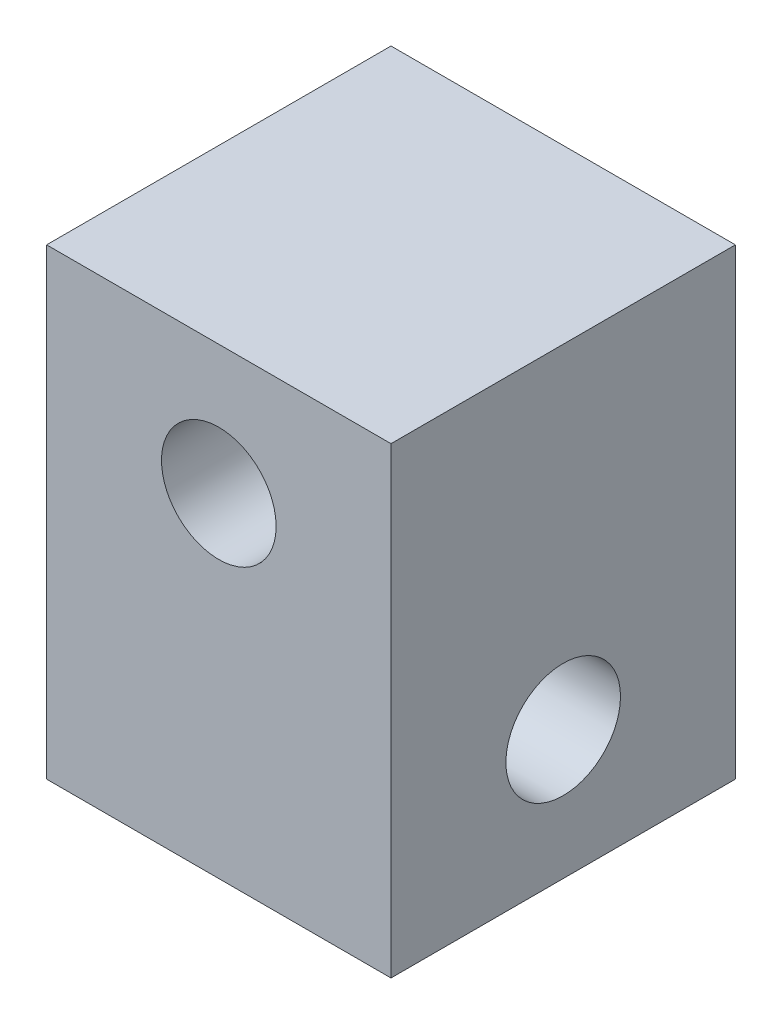
ISO-10303-21;
HEADER;
FILE_DESCRIPTION(('STEP AP214'),'2;1');
FILE_NAME('part.step','',(''),(''),'','','');
FILE_SCHEMA(('AUTOMOTIVE_DESIGN { 1 0 10303 214 1 1 1 1 }'));
ENDSEC;
DATA;
#1=APPLICATION_CONTEXT('core data for automotive mechanical design processes');
#2=APPLICATION_PROTOCOL_DEFINITION('international standard','automotive_design',2000,#1);
#3=PRODUCT_CONTEXT('',#1,'mechanical');
#4=PRODUCT('Part','Part','',(#3));
#5=PRODUCT_RELATED_PRODUCT_CATEGORY('part','',(#4));
#6=PRODUCT_DEFINITION_FORMATION('','',#4);
#7=PRODUCT_DEFINITION_CONTEXT('part definition',#1,'design');
#8=PRODUCT_DEFINITION('design','',#6,#7);
#9=PRODUCT_DEFINITION_SHAPE('','',#8);
#10=(LENGTH_UNIT() NAMED_UNIT(*) SI_UNIT(.MILLI.,.METRE.));
#11=(NAMED_UNIT(*) PLANE_ANGLE_UNIT() SI_UNIT($,.RADIAN.));
#12=(NAMED_UNIT(*) SI_UNIT($,.STERADIAN.) SOLID_ANGLE_UNIT());
#13=UNCERTAINTY_MEASURE_WITH_UNIT(LENGTH_MEASURE(1.E-05),#10,'distance_accuracy_value','');
#14=(GEOMETRIC_REPRESENTATION_CONTEXT(3) GLOBAL_UNCERTAINTY_ASSIGNED_CONTEXT((#13)) GLOBAL_UNIT_ASSIGNED_CONTEXT((#10,
#11,#12)) REPRESENTATION_CONTEXT('',''));
#15=CARTESIAN_POINT('',(0.,0.,0.));
#16=DIRECTION('',(0.,0.,1.));
#17=DIRECTION('',(1.,0.,0.));
#18=AXIS2_PLACEMENT_3D('',#15,#16,#17);
#19=CARTESIAN_POINT('',(0.,7.874,4.064));
#20=DIRECTION('',(0.,0.,1.));
#21=DIRECTION('',(1.,0.,0.));
#22=AXIS2_PLACEMENT_3D('',#19,#20,#21);
#23=CYLINDRICAL_SURFACE('',#22,1.35254999999999);
#24=CARTESIAN_POINT('',(0.,7.874,-4.064));
#25=DIRECTION('',(0.,0.,1.));
#26=DIRECTION('',(1.,0.,0.));
#27=AXIS2_PLACEMENT_3D('',#24,#25,#26);
#28=CIRCLE('',#27,1.35254999999999);
#29=CARTESIAN_POINT('',(1.35254999999999,7.874,-4.064));
#30=VERTEX_POINT('',#29);
#31=EDGE_CURVE('E75',#30,#30,#28,.F.);
#32=ORIENTED_EDGE('',*,*,#31,.T.);
#33=EDGE_LOOP('',(#32));
#34=FACE_BOUND('',#33,.T.);
#35=CARTESIAN_POINT('',(0.,7.874,4.064));
#36=DIRECTION('',(0.,0.,1.));
#37=DIRECTION('',(1.,0.,0.));
#38=AXIS2_PLACEMENT_3D('',#35,#36,#37);
#39=CIRCLE('',#38,1.35254999999999);
#40=CARTESIAN_POINT('',(1.35254999999999,7.874,4.064));
#41=VERTEX_POINT('',#40);
#42=EDGE_CURVE('E67',#41,#41,#39,.T.);
#43=ORIENTED_EDGE('',*,*,#42,.T.);
#44=EDGE_LOOP('',(#43));
#45=FACE_BOUND('',#44,.T.);
#46=ADVANCED_FACE('F17',(#34,#45),#23,.F.);
#47=CARTESIAN_POINT('',(-4.064,10.922,4.064));
#48=DIRECTION('',(1.,0.,0.));
#49=DIRECTION('',(0.,0.,-1.));
#50=AXIS2_PLACEMENT_3D('',#47,#48,#49);
#51=PLANE('',#50);
#52=DIRECTION('',(0.,1.,0.));
#53=VECTOR('',#52,1.);
#54=CARTESIAN_POINT('',(-4.064,10.922,4.064));
#55=LINE('',#54,#53);
#56=CARTESIAN_POINT('',(-4.064,0.,4.064));
#57=VERTEX_POINT('',#56);
#58=CARTESIAN_POINT('',(-4.064,10.922,4.064));
#59=VERTEX_POINT('',#58);
#60=EDGE_CURVE('E58',#57,#59,#55,.T.);
#61=ORIENTED_EDGE('',*,*,#60,.T.);
#62=DIRECTION('',(0.,0.,-1.));
#63=VECTOR('',#62,1.);
#64=CARTESIAN_POINT('',(-4.064,10.922,0.));
#65=LINE('',#64,#63);
#66=CARTESIAN_POINT('',(-4.064,10.922,-4.064));
#67=VERTEX_POINT('',#66);
#68=EDGE_CURVE('E55',#59,#67,#65,.T.);
#69=ORIENTED_EDGE('',*,*,#68,.T.);
#70=DIRECTION('',(0.,1.,0.));
#71=VECTOR('',#70,1.);
#72=CARTESIAN_POINT('',(-4.064,10.922,-4.064));
#73=LINE('',#72,#71);
#74=CARTESIAN_POINT('',(-4.064,0.,-4.064));
#75=VERTEX_POINT('',#74);
#76=EDGE_CURVE('E180',#67,#75,#73,.F.);
#77=ORIENTED_EDGE('',*,*,#76,.T.);
#78=DIRECTION('',(0.,0.,-1.));
#79=VECTOR('',#78,1.);
#80=CARTESIAN_POINT('',(-4.064,0.,0.));
#81=LINE('',#80,#79);
#82=EDGE_CURVE('E61',#57,#75,#81,.T.);
#83=ORIENTED_EDGE('',*,*,#82,.F.);
#84=EDGE_LOOP('',(#61,#69,#77,#83));
#85=FACE_BOUND('',#84,.T.);
#86=CARTESIAN_POINT('',(-4.064,3.048,0.));
#87=DIRECTION('',(1.,0.,0.));
#88=DIRECTION('',(0.,0.,-1.));
#89=AXIS2_PLACEMENT_3D('',#86,#87,#88);
#90=CIRCLE('',#89,1.35254999999999);
#91=CARTESIAN_POINT('',(-4.064,3.048,-1.35254999999999));
#92=VERTEX_POINT('',#91);
#93=EDGE_CURVE('E20',#92,#92,#90,.T.);
#94=ORIENTED_EDGE('',*,*,#93,.T.);
#95=EDGE_LOOP('',(#94));
#96=FACE_BOUND('',#95,.T.);
#97=ADVANCED_FACE('F59',(#85,#96),#51,.F.);
#98=CARTESIAN_POINT('',(4.064,3.048,0.));
#99=DIRECTION('',(1.,0.,0.));
#100=DIRECTION('',(0.,0.,-1.));
#101=AXIS2_PLACEMENT_3D('',#98,#99,#100);
#102=CYLINDRICAL_SURFACE('',#101,1.35254999999999);
#103=ORIENTED_EDGE('',*,*,#93,.F.);
#104=EDGE_LOOP('',(#103));
#105=FACE_BOUND('',#104,.T.);
#106=CARTESIAN_POINT('',(4.064,3.048,0.));
#107=DIRECTION('',(1.,0.,0.));
#108=DIRECTION('',(0.,0.,-1.));
#109=AXIS2_PLACEMENT_3D('',#106,#107,#108);
#110=CIRCLE('',#109,1.35254999999999);
#111=CARTESIAN_POINT('',(4.064,3.048,-1.35254999999999));
#112=VERTEX_POINT('',#111);
#113=EDGE_CURVE('E84',#112,#112,#110,.T.);
#114=ORIENTED_EDGE('',*,*,#113,.T.);
#115=EDGE_LOOP('',(#114));
#116=FACE_BOUND('',#115,.T.);
#117=ADVANCED_FACE('F94',(#105,#116),#102,.F.);
#118=CARTESIAN_POINT('',(-4.064,10.922,4.064));
#119=DIRECTION('',(0.,0.,-1.));
#120=DIRECTION('',(-1.,0.,0.));
#121=AXIS2_PLACEMENT_3D('',#118,#119,#120);
#122=PLANE('',#121);
#123=DIRECTION('',(0.,1.,0.));
#124=VECTOR('',#123,1.);
#125=CARTESIAN_POINT('',(4.064,10.922,4.064));
#126=LINE('',#125,#124);
#127=CARTESIAN_POINT('',(4.064,0.,4.064));
#128=VERTEX_POINT('',#127);
#129=CARTESIAN_POINT('',(4.064,10.922,4.064));
#130=VERTEX_POINT('',#129);
#131=EDGE_CURVE('E80',#128,#130,#126,.T.);
#132=ORIENTED_EDGE('',*,*,#131,.T.);
#133=DIRECTION('',(1.,0.,0.));
#134=VECTOR('',#133,1.);
#135=CARTESIAN_POINT('',(0.,10.922,4.064));
#136=LINE('',#135,#134);
#137=EDGE_CURVE('E66',#130,#59,#136,.F.);
#138=ORIENTED_EDGE('',*,*,#137,.T.);
#139=ORIENTED_EDGE('',*,*,#60,.F.);
#140=DIRECTION('',(1.,0.,0.));
#141=VECTOR('',#140,1.);
#142=CARTESIAN_POINT('',(0.,0.,4.064));
#143=LINE('',#142,#141);
#144=EDGE_CURVE('E182',#128,#57,#143,.F.);
#145=ORIENTED_EDGE('',*,*,#144,.F.);
#146=EDGE_LOOP('',(#132,#138,#139,#145));
#147=FACE_BOUND('',#146,.T.);
#148=ORIENTED_EDGE('',*,*,#42,.F.);
#149=EDGE_LOOP('',(#148));
#150=FACE_BOUND('',#149,.T.);
#151=ADVANCED_FACE('F78',(#147,#150),#122,.F.);
#152=CARTESIAN_POINT('',(0.,10.922,0.));
#153=DIRECTION('',(0.,-1.,0.));
#154=DIRECTION('',(0.,0.,-1.));
#155=AXIS2_PLACEMENT_3D('',#152,#153,#154);
#156=PLANE('',#155);
#157=DIRECTION('',(1.,0.,0.));
#158=VECTOR('',#157,1.);
#159=CARTESIAN_POINT('',(-4.064,10.922,-4.064));
#160=LINE('',#159,#158);
#161=CARTESIAN_POINT('',(4.064,10.922,-4.064));
#162=VERTEX_POINT('',#161);
#163=EDGE_CURVE('E74',#162,#67,#160,.F.);
#164=ORIENTED_EDGE('',*,*,#163,.T.);
#165=ORIENTED_EDGE('',*,*,#68,.F.);
#166=ORIENTED_EDGE('',*,*,#137,.F.);
#167=DIRECTION('',(0.,0.,1.));
#168=VECTOR('',#167,1.);
#169=CARTESIAN_POINT('',(4.064,10.922,4.064));
#170=LINE('',#169,#168);
#171=EDGE_CURVE('E189',#130,#162,#170,.F.);
#172=ORIENTED_EDGE('',*,*,#171,.T.);
#173=EDGE_LOOP('',(#164,#165,#166,#172));
#174=FACE_BOUND('',#173,.T.);
#175=ADVANCED_FACE('F71',(#174),#156,.F.);
#176=CARTESIAN_POINT('',(-4.064,10.922,-4.064));
#177=DIRECTION('',(0.,0.,1.));
#178=DIRECTION('',(1.,0.,0.));
#179=AXIS2_PLACEMENT_3D('',#176,#177,#178);
#180=PLANE('',#179);
#181=ORIENTED_EDGE('',*,*,#76,.F.);
#182=ORIENTED_EDGE('',*,*,#163,.F.);
#183=DIRECTION('',(0.,1.,0.));
#184=VECTOR('',#183,1.);
#185=CARTESIAN_POINT('',(4.064,10.922,-4.064));
#186=LINE('',#185,#184);
#187=CARTESIAN_POINT('',(4.064,0.,-4.064));
#188=VERTEX_POINT('',#187);
#189=EDGE_CURVE('E26',#162,#188,#186,.F.);
#190=ORIENTED_EDGE('',*,*,#189,.T.);
#191=DIRECTION('',(1.,0.,0.));
#192=VECTOR('',#191,1.);
#193=CARTESIAN_POINT('',(0.,0.,-4.064));
#194=LINE('',#193,#192);
#195=EDGE_CURVE('E34',#75,#188,#194,.T.);
#196=ORIENTED_EDGE('',*,*,#195,.F.);
#197=EDGE_LOOP('',(#181,#182,#190,#196));
#198=FACE_BOUND('',#197,.T.);
#199=ORIENTED_EDGE('',*,*,#31,.F.);
#200=EDGE_LOOP('',(#199));
#201=FACE_BOUND('',#200,.T.);
#202=ADVANCED_FACE('F109',(#198,#201),#180,.F.);
#203=CARTESIAN_POINT('',(0.,0.,0.));
#204=DIRECTION('',(0.,-1.,0.));
#205=DIRECTION('',(0.,0.,-1.));
#206=AXIS2_PLACEMENT_3D('',#203,#204,#205);
#207=PLANE('',#206);
#208=ORIENTED_EDGE('',*,*,#82,.T.);
#209=ORIENTED_EDGE('',*,*,#195,.T.);
#210=DIRECTION('',(0.,0.,1.));
#211=VECTOR('',#210,1.);
#212=CARTESIAN_POINT('',(4.064,0.,4.064));
#213=LINE('',#212,#211);
#214=EDGE_CURVE('E10',#188,#128,#213,.T.);
#215=ORIENTED_EDGE('',*,*,#214,.T.);
#216=ORIENTED_EDGE('',*,*,#144,.T.);
#217=EDGE_LOOP('',(#208,#209,#215,#216));
#218=FACE_BOUND('',#217,.T.);
#219=ADVANCED_FACE('F102',(#218),#207,.T.);
#220=CARTESIAN_POINT('',(4.064,10.922,4.064));
#221=DIRECTION('',(-1.,0.,0.));
#222=DIRECTION('',(0.,0.,1.));
#223=AXIS2_PLACEMENT_3D('',#220,#221,#222);
#224=PLANE('',#223);
#225=ORIENTED_EDGE('',*,*,#189,.F.);
#226=ORIENTED_EDGE('',*,*,#171,.F.);
#227=ORIENTED_EDGE('',*,*,#131,.F.);
#228=ORIENTED_EDGE('',*,*,#214,.F.);
#229=EDGE_LOOP('',(#225,#226,#227,#228));
#230=FACE_BOUND('',#229,.T.);
#231=ORIENTED_EDGE('',*,*,#113,.F.);
#232=EDGE_LOOP('',(#231));
#233=FACE_BOUND('',#232,.T.);
#234=ADVANCED_FACE('F100',(#230,#233),#224,.F.);
#235=CLOSED_SHELL('',(#46,#97,#117,#151,#175,#202,#219,#234));
#236=MANIFOLD_SOLID_BREP('B1',#235);
#237=ADVANCED_BREP_SHAPE_REPRESENTATION('',(#18,#236),#14);
#238=SHAPE_DEFINITION_REPRESENTATION(#9,#237);
ENDSEC;
END-ISO-10303-21;
